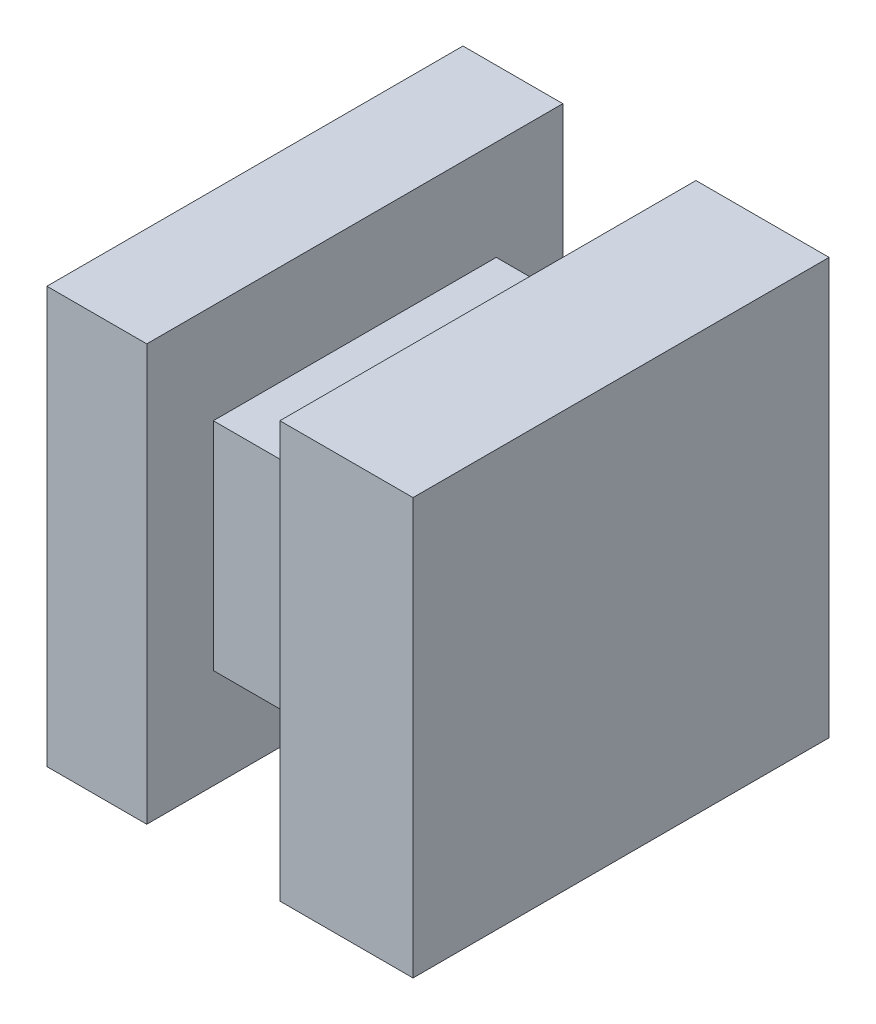
ISO-10303-21;
HEADER;
FILE_DESCRIPTION(('STEP AP214'),'2;1');
FILE_NAME('part.step','',(''),(''),'','','');
FILE_SCHEMA(('AUTOMOTIVE_DESIGN { 1 0 10303 214 1 1 1 1 }'));
ENDSEC;
DATA;
#1=APPLICATION_CONTEXT('core data for automotive mechanical design processes');
#2=APPLICATION_PROTOCOL_DEFINITION('international standard','automotive_design',2000,#1);
#3=PRODUCT_CONTEXT('',#1,'mechanical');
#4=PRODUCT('Part','Part','',(#3));
#5=PRODUCT_RELATED_PRODUCT_CATEGORY('part','',(#4));
#6=PRODUCT_DEFINITION_FORMATION('','',#4);
#7=PRODUCT_DEFINITION_CONTEXT('part definition',#1,'design');
#8=PRODUCT_DEFINITION('design','',#6,#7);
#9=PRODUCT_DEFINITION_SHAPE('','',#8);
#10=(LENGTH_UNIT() NAMED_UNIT(*) SI_UNIT(.MILLI.,.METRE.));
#11=(NAMED_UNIT(*) PLANE_ANGLE_UNIT() SI_UNIT($,.RADIAN.));
#12=(NAMED_UNIT(*) SI_UNIT($,.STERADIAN.) SOLID_ANGLE_UNIT());
#13=UNCERTAINTY_MEASURE_WITH_UNIT(LENGTH_MEASURE(1.E-05),#10,'distance_accuracy_value','');
#14=(GEOMETRIC_REPRESENTATION_CONTEXT(3) GLOBAL_UNCERTAINTY_ASSIGNED_CONTEXT((#13)) GLOBAL_UNIT_ASSIGNED_CONTEXT((#10,
#11,#12)) REPRESENTATION_CONTEXT('',''));
#15=CARTESIAN_POINT('',(0.,0.,0.));
#16=DIRECTION('',(0.,0.,1.));
#17=DIRECTION('',(1.,0.,0.));
#18=AXIS2_PLACEMENT_3D('',#15,#16,#17);
#19=CARTESIAN_POINT('',(-87.6145773733258,35.9594081977058,12.5));
#20=DIRECTION('',(0.,1.,0.));
#21=DIRECTION('',(0.,0.,1.));
#22=AXIS2_PLACEMENT_3D('',#19,#20,#21);
#23=PLANE('',#22);
#24=DIRECTION('',(-1.,0.,0.));
#25=VECTOR('',#24,1.);
#26=CARTESIAN_POINT('',(-87.6145773733258,35.9594081977058,2.));
#27=LINE('',#26,#25);
#28=CARTESIAN_POINT('',(-83.6145773733258,35.9594081977058,2.));
#29=VERTEX_POINT('',#28);
#30=CARTESIAN_POINT('',(-87.6145773733258,35.9594081977058,2.));
#31=VERTEX_POINT('',#30);
#32=EDGE_CURVE('E50',#29,#31,#27,.T.);
#33=ORIENTED_EDGE('',*,*,#32,.F.);
#34=DIRECTION('',(0.,0.,-1.));
#35=VECTOR('',#34,1.);
#36=CARTESIAN_POINT('',(-83.6145773733258,35.9594081977058,12.5));
#37=LINE('',#36,#35);
#38=CARTESIAN_POINT('',(-83.6145773733258,35.9594081977058,10.5));
#39=VERTEX_POINT('',#38);
#40=EDGE_CURVE('E158',#39,#29,#37,.T.);
#41=ORIENTED_EDGE('',*,*,#40,.F.);
#42=DIRECTION('',(-1.,0.,0.));
#43=VECTOR('',#42,1.);
#44=CARTESIAN_POINT('',(-87.6145773733258,35.9594081977058,10.5));
#45=LINE('',#44,#43);
#46=CARTESIAN_POINT('',(-87.6145773733258,35.9594081977058,10.5));
#47=VERTEX_POINT('',#46);
#48=EDGE_CURVE('E131',#39,#47,#45,.T.);
#49=ORIENTED_EDGE('',*,*,#48,.T.);
#50=DIRECTION('',(0.,0.,-1.));
#51=VECTOR('',#50,1.);
#52=CARTESIAN_POINT('',(-87.6145773733258,35.9594081977058,12.5));
#53=LINE('',#52,#51);
#54=EDGE_CURVE('E160',#47,#31,#53,.T.);
#55=ORIENTED_EDGE('',*,*,#54,.T.);
#56=EDGE_LOOP('',(#33,#41,#49,#55));
#57=FACE_BOUND('',#56,.T.);
#58=ADVANCED_FACE('F35',(#57),#23,.F.);
#59=CARTESIAN_POINT('',(-87.6145773733258,42.4594081977058,12.5));
#60=DIRECTION('',(0.,-1.,0.));
#61=DIRECTION('',(0.,0.,-1.));
#62=AXIS2_PLACEMENT_3D('',#59,#60,#61);
#63=PLANE('',#62);
#64=DIRECTION('',(1.,0.,0.));
#65=VECTOR('',#64,1.);
#66=CARTESIAN_POINT('',(-87.6145773733258,42.4594081977058,2.));
#67=LINE('',#66,#65);
#68=CARTESIAN_POINT('',(-87.6145773733258,42.4594081977058,2.));
#69=VERTEX_POINT('',#68);
#70=CARTESIAN_POINT('',(-83.6145773733258,42.4594081977058,2.));
#71=VERTEX_POINT('',#70);
#72=EDGE_CURVE('E227',#69,#71,#67,.T.);
#73=ORIENTED_EDGE('',*,*,#72,.F.);
#74=DIRECTION('',(0.,0.,-1.));
#75=VECTOR('',#74,1.);
#76=CARTESIAN_POINT('',(-87.6145773733258,42.4594081977058,12.5));
#77=LINE('',#76,#75);
#78=CARTESIAN_POINT('',(-87.6145773733258,42.4594081977058,10.5));
#79=VERTEX_POINT('',#78);
#80=EDGE_CURVE('E137',#79,#69,#77,.T.);
#81=ORIENTED_EDGE('',*,*,#80,.F.);
#82=DIRECTION('',(-1.,0.,0.));
#83=VECTOR('',#82,1.);
#84=CARTESIAN_POINT('',(-87.6145773733258,42.4594081977058,10.5));
#85=LINE('',#84,#83);
#86=CARTESIAN_POINT('',(-83.6145773733258,42.4594081977058,10.5));
#87=VERTEX_POINT('',#86);
#88=EDGE_CURVE('E128',#87,#79,#85,.T.);
#89=ORIENTED_EDGE('',*,*,#88,.F.);
#90=DIRECTION('',(0.,0.,-1.));
#91=VECTOR('',#90,1.);
#92=CARTESIAN_POINT('',(-83.6145773733258,42.4594081977058,12.5));
#93=LINE('',#92,#91);
#94=EDGE_CURVE('E58',#87,#71,#93,.T.);
#95=ORIENTED_EDGE('',*,*,#94,.T.);
#96=EDGE_LOOP('',(#73,#81,#89,#95));
#97=FACE_BOUND('',#96,.T.);
#98=ADVANCED_FACE('F135',(#97),#63,.F.);
#99=CARTESIAN_POINT('',(0.,0.,0.));
#100=DIRECTION('',(0.,0.,1.));
#101=DIRECTION('',(1.,0.,0.));
#102=AXIS2_PLACEMENT_3D('',#99,#100,#101);
#103=PLANE('',#102);
#104=DIRECTION('',(0.,1.,0.));
#105=VECTOR('',#104,1.);
#106=CARTESIAN_POINT('',(-87.6145773733258,45.4594081977058,0.));
#107=LINE('',#106,#105);
#108=CARTESIAN_POINT('',(-87.6145773733258,32.9594081977058,0.));
#109=VERTEX_POINT('',#108);
#110=CARTESIAN_POINT('',(-87.6145773733258,45.4594081977058,0.));
#111=VERTEX_POINT('',#110);
#112=EDGE_CURVE('E169',#109,#111,#107,.T.);
#113=ORIENTED_EDGE('',*,*,#112,.F.);
#114=DIRECTION('',(1.,0.,0.));
#115=VECTOR('',#114,1.);
#116=CARTESIAN_POINT('',(-90.6145773733258,32.9594081977058,0.));
#117=LINE('',#116,#115);
#118=CARTESIAN_POINT('',(-90.6145773733258,32.9594081977058,0.));
#119=VERTEX_POINT('',#118);
#120=EDGE_CURVE('E177',#119,#109,#117,.T.);
#121=ORIENTED_EDGE('',*,*,#120,.F.);
#122=DIRECTION('',(0.,-1.,0.));
#123=VECTOR('',#122,1.);
#124=CARTESIAN_POINT('',(-90.6145773733258,45.4594081977058,0.));
#125=LINE('',#124,#123);
#126=CARTESIAN_POINT('',(-90.6145773733258,45.4594081977058,0.));
#127=VERTEX_POINT('',#126);
#128=EDGE_CURVE('E185',#127,#119,#125,.T.);
#129=ORIENTED_EDGE('',*,*,#128,.F.);
#130=DIRECTION('',(-1.,0.,0.));
#131=VECTOR('',#130,1.);
#132=CARTESIAN_POINT('',(-90.6145773733258,45.4594081977058,0.));
#133=LINE('',#132,#131);
#134=EDGE_CURVE('E178',#111,#127,#133,.T.);
#135=ORIENTED_EDGE('',*,*,#134,.F.);
#136=EDGE_LOOP('',(#113,#121,#129,#135));
#137=FACE_BOUND('',#136,.T.);
#138=ADVANCED_FACE('F175',(#137),#103,.F.);
#139=DIRECTION('',(1.,0.,0.));
#140=VECTOR('',#139,1.);
#141=CARTESIAN_POINT('',(-83.6145773733258,32.9594081977058,0.));
#142=LINE('',#141,#140);
#143=CARTESIAN_POINT('',(-83.6145773733258,32.9594081977058,0.));
#144=VERTEX_POINT('',#143);
#145=CARTESIAN_POINT('',(-79.6145773733258,32.9594081977058,0.));
#146=VERTEX_POINT('',#145);
#147=EDGE_CURVE('E184',#144,#146,#142,.T.);
#148=ORIENTED_EDGE('',*,*,#147,.F.);
#149=DIRECTION('',(0.,-1.,0.));
#150=VECTOR('',#149,1.);
#151=CARTESIAN_POINT('',(-83.6145773733258,42.4594081977058,0.));
#152=LINE('',#151,#150);
#153=CARTESIAN_POINT('',(-83.6145773733258,45.4594081977058,0.));
#154=VERTEX_POINT('',#153);
#155=EDGE_CURVE('E179',#154,#144,#152,.T.);
#156=ORIENTED_EDGE('',*,*,#155,.F.);
#157=DIRECTION('',(-1.,0.,0.));
#158=VECTOR('',#157,1.);
#159=CARTESIAN_POINT('',(-83.6145773733258,45.4594081977058,0.));
#160=LINE('',#159,#158);
#161=CARTESIAN_POINT('',(-79.6145773733258,45.4594081977058,0.));
#162=VERTEX_POINT('',#161);
#163=EDGE_CURVE('E193',#162,#154,#160,.T.);
#164=ORIENTED_EDGE('',*,*,#163,.F.);
#165=DIRECTION('',(0.,1.,0.));
#166=VECTOR('',#165,1.);
#167=CARTESIAN_POINT('',(-79.6145773733258,45.4594081977058,0.));
#168=LINE('',#167,#166);
#169=EDGE_CURVE('E187',#146,#162,#168,.T.);
#170=ORIENTED_EDGE('',*,*,#169,.F.);
#171=EDGE_LOOP('',(#148,#156,#164,#170));
#172=FACE_BOUND('',#171,.T.);
#173=ADVANCED_FACE('F257',(#172),#103,.F.);
#174=CARTESIAN_POINT('',(0.,0.,12.5));
#175=DIRECTION('',(0.,0.,1.));
#176=DIRECTION('',(1.,0.,0.));
#177=AXIS2_PLACEMENT_3D('',#174,#175,#176);
#178=PLANE('',#177);
#179=DIRECTION('',(0.,1.,0.));
#180=VECTOR('',#179,1.);
#181=CARTESIAN_POINT('',(-87.6145773733258,32.9594081977058,12.5));
#182=LINE('',#181,#180);
#183=CARTESIAN_POINT('',(-87.6145773733258,32.9594081977058,12.5));
#184=VERTEX_POINT('',#183);
#185=CARTESIAN_POINT('',(-87.6145773733258,45.4594081977058,12.5));
#186=VERTEX_POINT('',#185);
#187=EDGE_CURVE('E171',#184,#186,#182,.T.);
#188=ORIENTED_EDGE('',*,*,#187,.T.);
#189=DIRECTION('',(-1.,0.,0.));
#190=VECTOR('',#189,1.);
#191=CARTESIAN_POINT('',(-90.6145773733258,45.4594081977058,12.5));
#192=LINE('',#191,#190);
#193=CARTESIAN_POINT('',(-90.6145773733258,45.4594081977058,12.5));
#194=VERTEX_POINT('',#193);
#195=EDGE_CURVE('E202',#186,#194,#192,.T.);
#196=ORIENTED_EDGE('',*,*,#195,.T.);
#197=DIRECTION('',(0.,-1.,0.));
#198=VECTOR('',#197,1.);
#199=CARTESIAN_POINT('',(-90.6145773733258,45.4594081977058,12.5));
#200=LINE('',#199,#198);
#201=CARTESIAN_POINT('',(-90.6145773733258,32.9594081977058,12.5));
#202=VERTEX_POINT('',#201);
#203=EDGE_CURVE('E199',#194,#202,#200,.T.);
#204=ORIENTED_EDGE('',*,*,#203,.T.);
#205=DIRECTION('',(1.,0.,0.));
#206=VECTOR('',#205,1.);
#207=CARTESIAN_POINT('',(-90.6145773733258,32.9594081977058,12.5));
#208=LINE('',#207,#206);
#209=EDGE_CURVE('E221',#202,#184,#208,.T.);
#210=ORIENTED_EDGE('',*,*,#209,.T.);
#211=EDGE_LOOP('',(#188,#196,#204,#210));
#212=FACE_BOUND('',#211,.T.);
#213=ADVANCED_FACE('F252',(#212),#178,.T.);
#214=CARTESIAN_POINT('',(-90.6145773733258,45.4594081977058,12.5));
#215=DIRECTION('',(1.,0.,0.));
#216=DIRECTION('',(0.,0.,-1.));
#217=AXIS2_PLACEMENT_3D('',#214,#215,#216);
#218=PLANE('',#217);
#219=ORIENTED_EDGE('',*,*,#128,.T.);
#220=DIRECTION('',(0.,0.,-1.));
#221=VECTOR('',#220,1.);
#222=CARTESIAN_POINT('',(-90.6145773733258,32.9594081977058,12.5));
#223=LINE('',#222,#221);
#224=EDGE_CURVE('E11',#202,#119,#223,.T.);
#225=ORIENTED_EDGE('',*,*,#224,.F.);
#226=ORIENTED_EDGE('',*,*,#203,.F.);
#227=DIRECTION('',(0.,0.,-1.));
#228=VECTOR('',#227,1.);
#229=CARTESIAN_POINT('',(-90.6145773733258,45.4594081977058,12.5));
#230=LINE('',#229,#228);
#231=EDGE_CURVE('E200',#194,#127,#230,.T.);
#232=ORIENTED_EDGE('',*,*,#231,.T.);
#233=EDGE_LOOP('',(#219,#225,#226,#232));
#234=FACE_BOUND('',#233,.T.);
#235=ADVANCED_FACE('F37',(#234),#218,.F.);
#236=CARTESIAN_POINT('',(-90.6145773733258,32.9594081977058,12.5));
#237=DIRECTION('',(0.,1.,0.));
#238=DIRECTION('',(0.,0.,1.));
#239=AXIS2_PLACEMENT_3D('',#236,#237,#238);
#240=PLANE('',#239);
#241=ORIENTED_EDGE('',*,*,#120,.T.);
#242=DIRECTION('',(0.,0.,-1.));
#243=VECTOR('',#242,1.);
#244=CARTESIAN_POINT('',(-87.6145773733258,32.9594081977058,12.5));
#245=LINE('',#244,#243);
#246=EDGE_CURVE('E43',#184,#109,#245,.T.);
#247=ORIENTED_EDGE('',*,*,#246,.F.);
#248=ORIENTED_EDGE('',*,*,#209,.F.);
#249=ORIENTED_EDGE('',*,*,#224,.T.);
#250=EDGE_LOOP('',(#241,#247,#248,#249));
#251=FACE_BOUND('',#250,.T.);
#252=ADVANCED_FACE('F181',(#251),#240,.F.);
#253=CARTESIAN_POINT('',(-83.6145773733258,32.9594081977058,12.5));
#254=DIRECTION('',(0.,1.,0.));
#255=DIRECTION('',(0.,0.,1.));
#256=AXIS2_PLACEMENT_3D('',#253,#254,#255);
#257=PLANE('',#256);
#258=ORIENTED_EDGE('',*,*,#147,.T.);
#259=DIRECTION('',(0.,0.,-1.));
#260=VECTOR('',#259,1.);
#261=CARTESIAN_POINT('',(-79.6145773733258,32.9594081977058,12.5));
#262=LINE('',#261,#260);
#263=CARTESIAN_POINT('',(-79.6145773733258,32.9594081977058,12.5));
#264=VERTEX_POINT('',#263);
#265=EDGE_CURVE('E153',#264,#146,#262,.T.);
#266=ORIENTED_EDGE('',*,*,#265,.F.);
#267=DIRECTION('',(1.,0.,0.));
#268=VECTOR('',#267,1.);
#269=CARTESIAN_POINT('',(-83.6145773733258,32.9594081977058,12.5));
#270=LINE('',#269,#268);
#271=CARTESIAN_POINT('',(-83.6145773733258,32.9594081977058,12.5));
#272=VERTEX_POINT('',#271);
#273=EDGE_CURVE('E216',#272,#264,#270,.T.);
#274=ORIENTED_EDGE('',*,*,#273,.F.);
#275=DIRECTION('',(0.,0.,-1.));
#276=VECTOR('',#275,1.);
#277=CARTESIAN_POINT('',(-83.6145773733258,32.9594081977058,12.5));
#278=LINE('',#277,#276);
#279=EDGE_CURVE('E156',#272,#144,#278,.T.);
#280=ORIENTED_EDGE('',*,*,#279,.T.);
#281=EDGE_LOOP('',(#258,#266,#274,#280));
#282=FACE_BOUND('',#281,.T.);
#283=ADVANCED_FACE('F243',(#282),#257,.F.);
#284=CARTESIAN_POINT('',(-79.6145773733258,45.4594081977058,12.5));
#285=DIRECTION('',(-1.,0.,0.));
#286=DIRECTION('',(0.,-1.,0.));
#287=AXIS2_PLACEMENT_3D('',#284,#285,#286);
#288=PLANE('',#287);
#289=ORIENTED_EDGE('',*,*,#169,.T.);
#290=DIRECTION('',(0.,0.,-1.));
#291=VECTOR('',#290,1.);
#292=CARTESIAN_POINT('',(-79.6145773733258,45.4594081977058,12.5));
#293=LINE('',#292,#291);
#294=CARTESIAN_POINT('',(-79.6145773733258,45.4594081977058,12.5));
#295=VERTEX_POINT('',#294);
#296=EDGE_CURVE('E145',#295,#162,#293,.T.);
#297=ORIENTED_EDGE('',*,*,#296,.F.);
#298=DIRECTION('',(0.,1.,0.));
#299=VECTOR('',#298,1.);
#300=CARTESIAN_POINT('',(-79.6145773733258,45.4594081977058,12.5));
#301=LINE('',#300,#299);
#302=EDGE_CURVE('E212',#264,#295,#301,.T.);
#303=ORIENTED_EDGE('',*,*,#302,.F.);
#304=ORIENTED_EDGE('',*,*,#265,.T.);
#305=EDGE_LOOP('',(#289,#297,#303,#304));
#306=FACE_BOUND('',#305,.T.);
#307=ADVANCED_FACE('F250',(#306),#288,.F.);
#308=CARTESIAN_POINT('',(-83.6145773733258,45.4594081977058,12.5));
#309=DIRECTION('',(0.,-1.,0.));
#310=DIRECTION('',(0.,0.,-1.));
#311=AXIS2_PLACEMENT_3D('',#308,#309,#310);
#312=PLANE('',#311);
#313=ORIENTED_EDGE('',*,*,#163,.T.);
#314=DIRECTION('',(0.,0.,-1.));
#315=VECTOR('',#314,1.);
#316=CARTESIAN_POINT('',(-83.6145773733258,45.4594081977058,12.5));
#317=LINE('',#316,#315);
#318=CARTESIAN_POINT('',(-83.6145773733258,45.4594081977058,12.5));
#319=VERTEX_POINT('',#318);
#320=EDGE_CURVE('E143',#319,#154,#317,.T.);
#321=ORIENTED_EDGE('',*,*,#320,.F.);
#322=DIRECTION('',(-1.,0.,0.));
#323=VECTOR('',#322,1.);
#324=CARTESIAN_POINT('',(-83.6145773733258,45.4594081977058,12.5));
#325=LINE('',#324,#323);
#326=EDGE_CURVE('E210',#295,#319,#325,.T.);
#327=ORIENTED_EDGE('',*,*,#326,.F.);
#328=ORIENTED_EDGE('',*,*,#296,.T.);
#329=EDGE_LOOP('',(#313,#321,#327,#328));
#330=FACE_BOUND('',#329,.T.);
#331=ADVANCED_FACE('F279',(#330),#312,.F.);
#332=CARTESIAN_POINT('',(-83.6145773733258,42.4594081977058,12.5));
#333=DIRECTION('',(1.,0.,0.));
#334=DIRECTION('',(0.,0.,-1.));
#335=AXIS2_PLACEMENT_3D('',#332,#333,#334);
#336=PLANE('',#335);
#337=ORIENTED_EDGE('',*,*,#155,.T.);
#338=ORIENTED_EDGE('',*,*,#279,.F.);
#339=DIRECTION('',(0.,-1.,0.));
#340=VECTOR('',#339,1.);
#341=CARTESIAN_POINT('',(-83.6145773733258,35.9594081977058,12.5));
#342=LINE('',#341,#340);
#343=EDGE_CURVE('E218',#319,#272,#342,.T.);
#344=ORIENTED_EDGE('',*,*,#343,.F.);
#345=ORIENTED_EDGE('',*,*,#320,.T.);
#346=EDGE_LOOP('',(#337,#338,#344,#345));
#347=FACE_BOUND('',#346,.T.);
#348=ORIENTED_EDGE('',*,*,#40,.T.);
#349=DIRECTION('',(0.,-1.,0.));
#350=VECTOR('',#349,1.);
#351=CARTESIAN_POINT('',(-83.6145773733258,72.2352367147771,2.));
#352=LINE('',#351,#350);
#353=EDGE_CURVE('E142',#71,#29,#352,.T.);
#354=ORIENTED_EDGE('',*,*,#353,.F.);
#355=ORIENTED_EDGE('',*,*,#94,.F.);
#356=DIRECTION('',(0.,1.,0.));
#357=VECTOR('',#356,1.);
#358=CARTESIAN_POINT('',(-83.6145773733258,16.4594081977058,10.5));
#359=LINE('',#358,#357);
#360=EDGE_CURVE('E126',#39,#87,#359,.T.);
#361=ORIENTED_EDGE('',*,*,#360,.F.);
#362=EDGE_LOOP('',(#348,#354,#355,#361));
#363=FACE_BOUND('',#362,.T.);
#364=ADVANCED_FACE('F140',(#347,#363),#336,.F.);
#365=CARTESIAN_POINT('',(-87.6145773733258,45.4594081977058,12.5));
#366=DIRECTION('',(-1.,0.,0.));
#367=DIRECTION('',(0.,0.,1.));
#368=AXIS2_PLACEMENT_3D('',#365,#366,#367);
#369=PLANE('',#368);
#370=ORIENTED_EDGE('',*,*,#246,.T.);
#371=ORIENTED_EDGE('',*,*,#112,.T.);
#372=DIRECTION('',(0.,0.,-1.));
#373=VECTOR('',#372,1.);
#374=CARTESIAN_POINT('',(-87.6145773733258,45.4594081977058,12.5));
#375=LINE('',#374,#373);
#376=EDGE_CURVE('E147',#186,#111,#375,.T.);
#377=ORIENTED_EDGE('',*,*,#376,.F.);
#378=ORIENTED_EDGE('',*,*,#187,.F.);
#379=EDGE_LOOP('',(#370,#371,#377,#378));
#380=FACE_BOUND('',#379,.T.);
#381=DIRECTION('',(0.,-1.,0.));
#382=VECTOR('',#381,1.);
#383=CARTESIAN_POINT('',(-87.6145773733258,72.2352367147771,2.));
#384=LINE('',#383,#382);
#385=EDGE_CURVE('E229',#69,#31,#384,.T.);
#386=ORIENTED_EDGE('',*,*,#385,.T.);
#387=ORIENTED_EDGE('',*,*,#54,.F.);
#388=DIRECTION('',(0.,1.,0.));
#389=VECTOR('',#388,1.);
#390=CARTESIAN_POINT('',(-87.6145773733258,16.4594081977058,10.5));
#391=LINE('',#390,#389);
#392=EDGE_CURVE('E133',#47,#79,#391,.T.);
#393=ORIENTED_EDGE('',*,*,#392,.T.);
#394=ORIENTED_EDGE('',*,*,#80,.T.);
#395=EDGE_LOOP('',(#386,#387,#393,#394));
#396=FACE_BOUND('',#395,.T.);
#397=ADVANCED_FACE('F166',(#380,#396),#369,.F.);
#398=CARTESIAN_POINT('',(-90.6145773733258,45.4594081977058,12.5));
#399=DIRECTION('',(0.,-1.,0.));
#400=DIRECTION('',(0.,0.,-1.));
#401=AXIS2_PLACEMENT_3D('',#398,#399,#400);
#402=PLANE('',#401);
#403=ORIENTED_EDGE('',*,*,#134,.T.);
#404=ORIENTED_EDGE('',*,*,#231,.F.);
#405=ORIENTED_EDGE('',*,*,#195,.F.);
#406=ORIENTED_EDGE('',*,*,#376,.T.);
#407=EDGE_LOOP('',(#403,#404,#405,#406));
#408=FACE_BOUND('',#407,.T.);
#409=ADVANCED_FACE('F205',(#408),#402,.F.);
#410=ORIENTED_EDGE('',*,*,#326,.T.);
#411=ORIENTED_EDGE('',*,*,#343,.T.);
#412=ORIENTED_EDGE('',*,*,#273,.T.);
#413=ORIENTED_EDGE('',*,*,#302,.T.);
#414=EDGE_LOOP('',(#410,#411,#412,#413));
#415=FACE_BOUND('',#414,.T.);
#416=ADVANCED_FACE('F259',(#415),#178,.T.);
#417=CARTESIAN_POINT('',(-87.6145773733258,16.4594081977058,10.5));
#418=DIRECTION('',(0.,0.,-1.));
#419=DIRECTION('',(-1.,0.,0.));
#420=AXIS2_PLACEMENT_3D('',#417,#418,#419);
#421=PLANE('',#420);
#422=ORIENTED_EDGE('',*,*,#360,.T.);
#423=ORIENTED_EDGE('',*,*,#88,.T.);
#424=ORIENTED_EDGE('',*,*,#392,.F.);
#425=ORIENTED_EDGE('',*,*,#48,.F.);
#426=EDGE_LOOP('',(#422,#423,#424,#425));
#427=FACE_BOUND('',#426,.T.);
#428=ADVANCED_FACE('F127',(#427),#421,.F.);
#429=CARTESIAN_POINT('',(-87.6145773733258,72.2352367147771,2.));
#430=DIRECTION('',(0.,0.,-1.));
#431=DIRECTION('',(-1.,0.,0.));
#432=AXIS2_PLACEMENT_3D('',#429,#430,#431);
#433=PLANE('',#432);
#434=ORIENTED_EDGE('',*,*,#353,.T.);
#435=ORIENTED_EDGE('',*,*,#32,.T.);
#436=ORIENTED_EDGE('',*,*,#385,.F.);
#437=ORIENTED_EDGE('',*,*,#72,.T.);
#438=EDGE_LOOP('',(#434,#435,#436,#437));
#439=FACE_BOUND('',#438,.T.);
#440=ADVANCED_FACE('F233',(#439),#433,.T.);
#441=CLOSED_SHELL('',(#58,#98,#138,#173,#213,#235,#252,#283,#307,#331,#364,#397,#409,#416,#428,#440));
#442=MANIFOLD_SOLID_BREP('B2',#441);
#443=ADVANCED_BREP_SHAPE_REPRESENTATION('',(#18,#442),#14);
#444=SHAPE_DEFINITION_REPRESENTATION(#9,#443);
ENDSEC;
END-ISO-10303-21;
